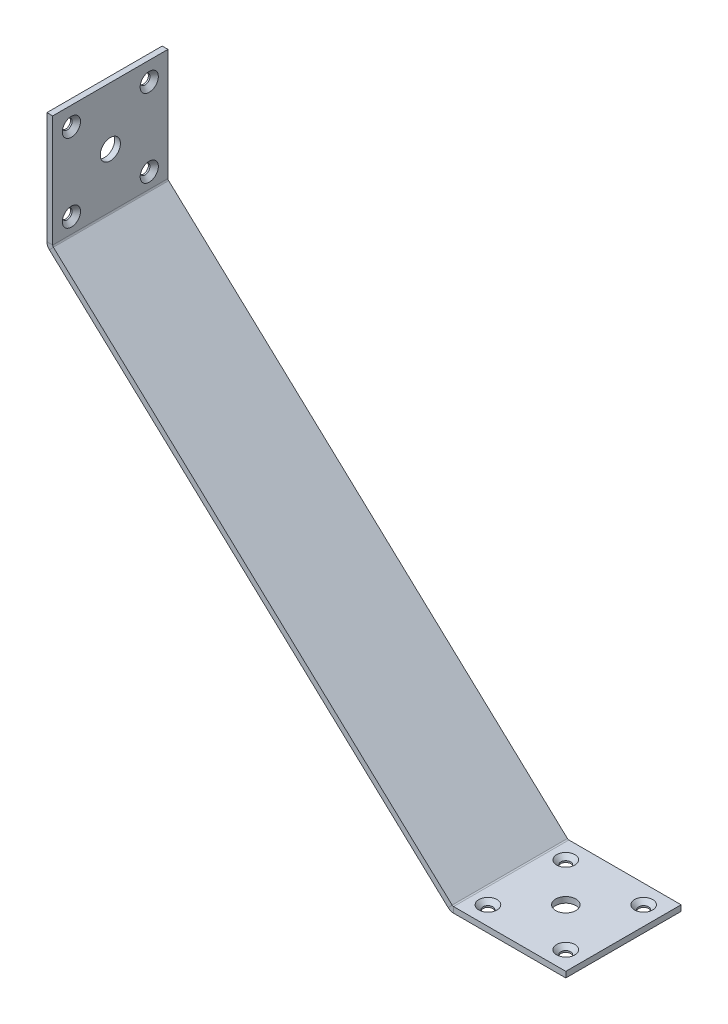
ISO-10303-21;
HEADER;
FILE_DESCRIPTION(('STEP AP214'),'2;1');
FILE_NAME('part.step','',(''),(''),'','','');
FILE_SCHEMA(('AUTOMOTIVE_DESIGN { 1 0 10303 214 1 1 1 1 }'));
ENDSEC;
DATA;
#1=APPLICATION_CONTEXT('core data for automotive mechanical design processes');
#2=APPLICATION_PROTOCOL_DEFINITION('international standard','automotive_design',2000,#1);
#3=PRODUCT_CONTEXT('',#1,'mechanical');
#4=PRODUCT('Part','Part','',(#3));
#5=PRODUCT_RELATED_PRODUCT_CATEGORY('part','',(#4));
#6=PRODUCT_DEFINITION_FORMATION('','',#4);
#7=PRODUCT_DEFINITION_CONTEXT('part definition',#1,'design');
#8=PRODUCT_DEFINITION('design','',#6,#7);
#9=PRODUCT_DEFINITION_SHAPE('','',#8);
#10=(LENGTH_UNIT() NAMED_UNIT(*) SI_UNIT(.MILLI.,.METRE.));
#11=(NAMED_UNIT(*) PLANE_ANGLE_UNIT() SI_UNIT($,.RADIAN.));
#12=(NAMED_UNIT(*) SI_UNIT($,.STERADIAN.) SOLID_ANGLE_UNIT());
#13=UNCERTAINTY_MEASURE_WITH_UNIT(LENGTH_MEASURE(1.E-05),#10,'distance_accuracy_value','');
#14=(GEOMETRIC_REPRESENTATION_CONTEXT(3) GLOBAL_UNCERTAINTY_ASSIGNED_CONTEXT((#13)) GLOBAL_UNIT_ASSIGNED_CONTEXT((#10,
#11,#12)) REPRESENTATION_CONTEXT('',''));
#15=CARTESIAN_POINT('',(0.,0.,0.));
#16=DIRECTION('',(0.,0.,1.));
#17=DIRECTION('',(1.,0.,0.));
#18=AXIS2_PLACEMENT_3D('',#15,#16,#17);
#19=CARTESIAN_POINT('',(0.,131.193347827818,40.));
#20=DIRECTION('',(0.,0.,1.));
#21=DIRECTION('',(1.,0.,0.));
#22=AXIS2_PLACEMENT_3D('',#19,#20,#21);
#23=PLANE('',#22);
#24=DIRECTION('',(1.,0.,0.));
#25=VECTOR('',#24,1.);
#26=CARTESIAN_POINT('',(0.,131.193347827818,40.));
#27=LINE('',#26,#25);
#28=CARTESIAN_POINT('',(0.,131.193347827818,40.));
#29=VERTEX_POINT('',#28);
#30=CARTESIAN_POINT('',(2.,131.193347827818,40.));
#31=VERTEX_POINT('',#30);
#32=EDGE_CURVE('E11',#29,#31,#27,.T.);
#33=ORIENTED_EDGE('',*,*,#32,.F.);
#34=CARTESIAN_POINT('',(2.7366,131.193347827818,40.));
#35=DIRECTION('',(0.,0.,-1.));
#36=DIRECTION('',(-1.,0.,0.));
#37=AXIS2_PLACEMENT_3D('',#34,#35,#36);
#38=CIRCLE('',#37,2.7366);
#39=CARTESIAN_POINT('',(0.874477521471504,129.187985158634,40.));
#40=VERTEX_POINT('',#39);
#41=EDGE_CURVE('E146',#29,#40,#38,.F.);
#42=ORIENTED_EDGE('',*,*,#41,.T.);
#43=DIRECTION('',(-0.680451099367275,-0.732793491626302,0.));
#44=VECTOR('',#43,1.);
#45=CARTESIAN_POINT('',(2.23537972020606,130.653572141886,40.));
#46=LINE('',#45,#44);
#47=CARTESIAN_POINT('',(2.23537972020606,130.653572141886,40.));
#48=VERTEX_POINT('',#47);
#49=EDGE_CURVE('E44',#48,#40,#46,.T.);
#50=ORIENTED_EDGE('',*,*,#49,.F.);
#51=CARTESIAN_POINT('',(2.7366,131.193347827818,40.));
#52=DIRECTION('',(0.,0.,1.));
#53=DIRECTION('',(1.,0.,0.));
#54=AXIS2_PLACEMENT_3D('',#51,#52,#53);
#55=CIRCLE('',#54,0.7366);
#56=EDGE_CURVE('E241',#31,#48,#55,.T.);
#57=ORIENTED_EDGE('',*,*,#56,.F.);
#58=EDGE_LOOP('',(#33,#42,#50,#57));
#59=FACE_BOUND('',#58,.T.);
#60=ADVANCED_FACE('F36',(#59),#23,.T.);
#61=CARTESIAN_POINT('',(2.23537972020606,130.653572141886,40.));
#62=DIRECTION('',(0.,0.,1.));
#63=DIRECTION('',(1.,0.,0.));
#64=AXIS2_PLACEMENT_3D('',#61,#62,#63);
#65=PLANE('',#64);
#66=DIRECTION('',(0.,-1.,0.));
#67=VECTOR('',#66,1.);
#68=CARTESIAN_POINT('',(0.,130.,40.));
#69=LINE('',#68,#67);
#70=CARTESIAN_POINT('',(0.,170.,40.));
#71=VERTEX_POINT('',#70);
#72=EDGE_CURVE('E151',#71,#29,#69,.T.);
#73=ORIENTED_EDGE('',*,*,#72,.T.);
#74=ORIENTED_EDGE('',*,*,#32,.T.);
#75=DIRECTION('',(0.,1.,0.));
#76=VECTOR('',#75,1.);
#77=CARTESIAN_POINT('',(2.,130.,40.));
#78=LINE('',#77,#76);
#79=CARTESIAN_POINT('',(2.,170.,40.));
#80=VERTEX_POINT('',#79);
#81=EDGE_CURVE('E254',#80,#31,#78,.F.);
#82=ORIENTED_EDGE('',*,*,#81,.F.);
#83=DIRECTION('',(1.,0.,0.));
#84=VECTOR('',#83,1.);
#85=CARTESIAN_POINT('',(0.,170.,40.));
#86=LINE('',#85,#84);
#87=EDGE_CURVE('E256',#71,#80,#86,.T.);
#88=ORIENTED_EDGE('',*,*,#87,.F.);
#89=EDGE_LOOP('',(#73,#74,#82,#88));
#90=FACE_BOUND('',#89,.T.);
#91=ADVANCED_FACE('F267',(#90),#65,.T.);
#92=CARTESIAN_POINT('',(0.874477521471504,129.187985158634,0.));
#93=DIRECTION('',(0.,0.,-1.));
#94=DIRECTION('',(-1.,0.,0.));
#95=AXIS2_PLACEMENT_3D('',#92,#93,#94);
#96=PLANE('',#95);
#97=DIRECTION('',(0.680451099367275,0.732793491626302,0.));
#98=VECTOR('',#97,1.);
#99=CARTESIAN_POINT('',(0.874477521471504,129.187985158634,0.));
#100=LINE('',#99,#98);
#101=CARTESIAN_POINT('',(0.874477521471504,129.187985158634,0.));
#102=VERTEX_POINT('',#101);
#103=CARTESIAN_POINT('',(2.23537972020606,130.653572141886,0.));
#104=VERTEX_POINT('',#103);
#105=EDGE_CURVE('E144',#102,#104,#100,.T.);
#106=ORIENTED_EDGE('',*,*,#105,.F.);
#107=CARTESIAN_POINT('',(2.7366,131.193347827818,0.));
#108=DIRECTION('',(0.,0.,-1.));
#109=DIRECTION('',(-1.,0.,0.));
#110=AXIS2_PLACEMENT_3D('',#107,#108,#109);
#111=CIRCLE('',#110,2.7366);
#112=CARTESIAN_POINT('',(0.,131.193347827818,0.));
#113=VERTEX_POINT('',#112);
#114=EDGE_CURVE('E158',#113,#102,#111,.F.);
#115=ORIENTED_EDGE('',*,*,#114,.F.);
#116=DIRECTION('',(-1.,0.,0.));
#117=VECTOR('',#116,1.);
#118=CARTESIAN_POINT('',(2.,131.193347827818,0.));
#119=LINE('',#118,#117);
#120=CARTESIAN_POINT('',(2.,131.193347827818,0.));
#121=VERTEX_POINT('',#120);
#122=EDGE_CURVE('E232',#121,#113,#119,.T.);
#123=ORIENTED_EDGE('',*,*,#122,.F.);
#124=CARTESIAN_POINT('',(2.7366,131.193347827818,0.));
#125=DIRECTION('',(0.,0.,1.));
#126=DIRECTION('',(1.,0.,0.));
#127=AXIS2_PLACEMENT_3D('',#124,#125,#126);
#128=CIRCLE('',#127,0.7366);
#129=EDGE_CURVE('E186',#121,#104,#128,.T.);
#130=ORIENTED_EDGE('',*,*,#129,.T.);
#131=EDGE_LOOP('',(#106,#115,#123,#130));
#132=FACE_BOUND('',#131,.T.);
#133=ADVANCED_FACE('F246',(#132),#96,.T.);
#134=CARTESIAN_POINT('',(2.,131.193347827818,0.));
#135=DIRECTION('',(0.,0.,-1.));
#136=DIRECTION('',(-1.,0.,0.));
#137=AXIS2_PLACEMENT_3D('',#134,#135,#136);
#138=PLANE('',#137);
#139=DIRECTION('',(0.732793491626299,-0.680451099367278,0.));
#140=VECTOR('',#139,1.);
#141=CARTESIAN_POINT('',(0.,130.,0.));
#142=LINE('',#141,#140);
#143=CARTESIAN_POINT('',(139.212513643737,0.731237330815426,0.));
#144=VERTEX_POINT('',#143);
#145=EDGE_CURVE('E199',#102,#144,#142,.T.);
#146=ORIENTED_EDGE('',*,*,#145,.F.);
#147=ORIENTED_EDGE('',*,*,#105,.T.);
#148=DIRECTION('',(0.732793491626299,-0.680451099367278,0.));
#149=VECTOR('',#148,1.);
#150=CARTESIAN_POINT('',(1.36090219873456,131.465586983253,0.));
#151=LINE('',#150,#149);
#152=CARTESIAN_POINT('',(140.573415842472,2.19682431406804,0.));
#153=VERTEX_POINT('',#152);
#154=EDGE_CURVE('E184',#104,#153,#151,.T.);
#155=ORIENTED_EDGE('',*,*,#154,.T.);
#156=DIRECTION('',(-0.680451099367273,-0.732793491626303,0.));
#157=VECTOR('',#156,1.);
#158=CARTESIAN_POINT('',(140.573415842472,2.19682431406804,0.));
#159=LINE('',#158,#157);
#160=EDGE_CURVE('E93',#153,#144,#159,.T.);
#161=ORIENTED_EDGE('',*,*,#160,.T.);
#162=EDGE_LOOP('',(#146,#147,#155,#161));
#163=FACE_BOUND('',#162,.T.);
#164=ADVANCED_FACE('F234',(#163),#138,.T.);
#165=CARTESIAN_POINT('',(139.212513643737,0.731237330815426,40.));
#166=DIRECTION('',(0.,0.,1.));
#167=DIRECTION('',(1.,0.,0.));
#168=AXIS2_PLACEMENT_3D('',#165,#166,#167);
#169=PLANE('',#168);
#170=DIRECTION('',(0.680451099367273,0.732793491626303,0.));
#171=VECTOR('',#170,1.);
#172=CARTESIAN_POINT('',(139.212513643737,0.731237330815426,40.));
#173=LINE('',#172,#171);
#174=CARTESIAN_POINT('',(139.212513643737,0.731237330815426,40.));
#175=VERTEX_POINT('',#174);
#176=CARTESIAN_POINT('',(140.573415842472,2.19682431406804,40.));
#177=VERTEX_POINT('',#176);
#178=EDGE_CURVE('E230',#175,#177,#173,.T.);
#179=ORIENTED_EDGE('',*,*,#178,.F.);
#180=CARTESIAN_POINT('',(141.074636122266,2.73659999999998,40.));
#181=DIRECTION('',(0.,0.,-1.));
#182=DIRECTION('',(-1.,0.,0.));
#183=AXIS2_PLACEMENT_3D('',#180,#181,#182);
#184=CIRCLE('',#183,2.7366);
#185=CARTESIAN_POINT('',(141.074636122266,0.,40.));
#186=VERTEX_POINT('',#185);
#187=EDGE_CURVE('E166',#175,#186,#184,.F.);
#188=ORIENTED_EDGE('',*,*,#187,.T.);
#189=DIRECTION('',(0.,-1.,0.));
#190=VECTOR('',#189,1.);
#191=CARTESIAN_POINT('',(141.074636122266,2.,40.));
#192=LINE('',#191,#190);
#193=CARTESIAN_POINT('',(141.074636122266,2.,40.));
#194=VERTEX_POINT('',#193);
#195=EDGE_CURVE('E52',#194,#186,#192,.T.);
#196=ORIENTED_EDGE('',*,*,#195,.F.);
#197=CARTESIAN_POINT('',(141.074636122266,2.73659999999998,40.));
#198=DIRECTION('',(0.,0.,1.));
#199=DIRECTION('',(1.,0.,0.));
#200=AXIS2_PLACEMENT_3D('',#197,#198,#199);
#201=CIRCLE('',#200,0.7366);
#202=EDGE_CURVE('E258',#177,#194,#201,.T.);
#203=ORIENTED_EDGE('',*,*,#202,.F.);
#204=EDGE_LOOP('',(#179,#188,#196,#203));
#205=FACE_BOUND('',#204,.T.);
#206=ADVANCED_FACE('F295',(#205),#169,.T.);
#207=CARTESIAN_POINT('',(141.074636122266,2.,40.));
#208=DIRECTION('',(0.,0.,1.));
#209=DIRECTION('',(1.,0.,0.));
#210=AXIS2_PLACEMENT_3D('',#207,#208,#209);
#211=PLANE('',#210);
#212=DIRECTION('',(0.732793491626299,-0.680451099367278,0.));
#213=VECTOR('',#212,1.);
#214=CARTESIAN_POINT('',(0.,130.,40.));
#215=LINE('',#214,#213);
#216=EDGE_CURVE('E136',#40,#175,#215,.T.);
#217=ORIENTED_EDGE('',*,*,#216,.T.);
#218=ORIENTED_EDGE('',*,*,#178,.T.);
#219=DIRECTION('',(0.732793491626299,-0.680451099367278,0.));
#220=VECTOR('',#219,1.);
#221=CARTESIAN_POINT('',(1.36090219873456,131.465586983253,40.));
#222=LINE('',#221,#220);
#223=EDGE_CURVE('E139',#48,#177,#222,.T.);
#224=ORIENTED_EDGE('',*,*,#223,.F.);
#225=ORIENTED_EDGE('',*,*,#49,.T.);
#226=EDGE_LOOP('',(#217,#218,#224,#225));
#227=FACE_BOUND('',#226,.T.);
#228=ADVANCED_FACE('F134',(#227),#211,.T.);
#229=CARTESIAN_POINT('',(141.074636122266,0.,0.));
#230=DIRECTION('',(0.,0.,-1.));
#231=DIRECTION('',(-1.,0.,0.));
#232=AXIS2_PLACEMENT_3D('',#229,#230,#231);
#233=PLANE('',#232);
#234=DIRECTION('',(0.,1.,0.));
#235=VECTOR('',#234,1.);
#236=CARTESIAN_POINT('',(141.074636122266,0.,0.));
#237=LINE('',#236,#235);
#238=CARTESIAN_POINT('',(141.074636122266,0.,0.));
#239=VERTEX_POINT('',#238);
#240=CARTESIAN_POINT('',(141.074636122266,2.,0.));
#241=VERTEX_POINT('',#240);
#242=EDGE_CURVE('E100',#239,#241,#237,.T.);
#243=ORIENTED_EDGE('',*,*,#242,.F.);
#244=CARTESIAN_POINT('',(141.074636122266,2.73659999999998,0.));
#245=DIRECTION('',(0.,0.,-1.));
#246=DIRECTION('',(-1.,0.,0.));
#247=AXIS2_PLACEMENT_3D('',#244,#245,#246);
#248=CIRCLE('',#247,2.7366);
#249=EDGE_CURVE('E201',#144,#239,#248,.F.);
#250=ORIENTED_EDGE('',*,*,#249,.F.);
#251=ORIENTED_EDGE('',*,*,#160,.F.);
#252=CARTESIAN_POINT('',(141.074636122266,2.73659999999998,0.));
#253=DIRECTION('',(0.,0.,1.));
#254=DIRECTION('',(1.,0.,0.));
#255=AXIS2_PLACEMENT_3D('',#252,#253,#254);
#256=CIRCLE('',#255,0.7366);
#257=EDGE_CURVE('E182',#153,#241,#256,.T.);
#258=ORIENTED_EDGE('',*,*,#257,.T.);
#259=EDGE_LOOP('',(#243,#250,#251,#258));
#260=FACE_BOUND('',#259,.T.);
#261=ADVANCED_FACE('F301',(#260),#233,.T.);
#262=CARTESIAN_POINT('',(140.573415842472,2.19682431406804,0.));
#263=DIRECTION('',(0.,0.,-1.));
#264=DIRECTION('',(-1.,0.,0.));
#265=AXIS2_PLACEMENT_3D('',#262,#263,#264);
#266=PLANE('',#265);
#267=DIRECTION('',(1.,0.,0.));
#268=VECTOR('',#267,1.);
#269=CARTESIAN_POINT('',(140.,0.,0.));
#270=LINE('',#269,#268);
#271=CARTESIAN_POINT('',(180.,0.,0.));
#272=VERTEX_POINT('',#271);
#273=EDGE_CURVE('E172',#239,#272,#270,.T.);
#274=ORIENTED_EDGE('',*,*,#273,.F.);
#275=ORIENTED_EDGE('',*,*,#242,.T.);
#276=DIRECTION('',(1.,0.,0.));
#277=VECTOR('',#276,1.);
#278=CARTESIAN_POINT('',(140.,2.,0.));
#279=LINE('',#278,#277);
#280=CARTESIAN_POINT('',(180.,2.,0.));
#281=VERTEX_POINT('',#280);
#282=EDGE_CURVE('E179',#241,#281,#279,.T.);
#283=ORIENTED_EDGE('',*,*,#282,.T.);
#284=DIRECTION('',(0.,-1.,0.));
#285=VECTOR('',#284,1.);
#286=CARTESIAN_POINT('',(180.,2.,0.));
#287=LINE('',#286,#285);
#288=EDGE_CURVE('E175',#281,#272,#287,.T.);
#289=ORIENTED_EDGE('',*,*,#288,.T.);
#290=EDGE_LOOP('',(#274,#275,#283,#289));
#291=FACE_BOUND('',#290,.T.);
#292=ADVANCED_FACE('F304',(#291),#266,.T.);
#293=CARTESIAN_POINT('',(140.,0.,40.));
#294=DIRECTION('',(0.,1.,0.));
#295=DIRECTION('',(0.,0.,1.));
#296=AXIS2_PLACEMENT_3D('',#293,#294,#295);
#297=PLANE('',#296);
#298=CARTESIAN_POINT('',(160.,0.,20.));
#299=DIRECTION('',(0.,1.,0.));
#300=DIRECTION('',(0.,0.,1.));
#301=AXIS2_PLACEMENT_3D('',#298,#299,#300);
#302=CIRCLE('',#301,3.49999999999998);
#303=CARTESIAN_POINT('',(160.,0.,23.5));
#304=VERTEX_POINT('',#303);
#305=EDGE_CURVE('E780',#304,#304,#302,.T.);
#306=ORIENTED_EDGE('',*,*,#305,.T.);
#307=EDGE_LOOP('',(#306));
#308=FACE_BOUND('',#307,.T.);
#309=CARTESIAN_POINT('',(173.5,0.,6.5));
#310=DIRECTION('',(0.,1.,0.));
#311=DIRECTION('',(0.,0.,1.));
#312=AXIS2_PLACEMENT_3D('',#309,#310,#311);
#313=CIRCLE('',#312,1.69999999999998);
#314=CARTESIAN_POINT('',(173.5,0.,8.19999999999998));
#315=VERTEX_POINT('',#314);
#316=EDGE_CURVE('E735',#315,#315,#313,.T.);
#317=ORIENTED_EDGE('',*,*,#316,.T.);
#318=EDGE_LOOP('',(#317));
#319=FACE_BOUND('',#318,.T.);
#320=CARTESIAN_POINT('',(173.5,0.,33.5));
#321=DIRECTION('',(0.,1.,0.));
#322=DIRECTION('',(0.,0.,1.));
#323=AXIS2_PLACEMENT_3D('',#320,#321,#322);
#324=CIRCLE('',#323,1.69999999999998);
#325=CARTESIAN_POINT('',(173.5,0.,35.2));
#326=VERTEX_POINT('',#325);
#327=EDGE_CURVE('E726',#326,#326,#324,.T.);
#328=ORIENTED_EDGE('',*,*,#327,.T.);
#329=EDGE_LOOP('',(#328));
#330=FACE_BOUND('',#329,.T.);
#331=CARTESIAN_POINT('',(146.5,0.,33.5));
#332=DIRECTION('',(0.,1.,0.));
#333=DIRECTION('',(0.,0.,1.));
#334=AXIS2_PLACEMENT_3D('',#331,#332,#333);
#335=CIRCLE('',#334,1.69999999999998);
#336=CARTESIAN_POINT('',(146.5,0.,35.2));
#337=VERTEX_POINT('',#336);
#338=EDGE_CURVE('E717',#337,#337,#335,.T.);
#339=ORIENTED_EDGE('',*,*,#338,.T.);
#340=EDGE_LOOP('',(#339));
#341=FACE_BOUND('',#340,.T.);
#342=CARTESIAN_POINT('',(146.5,0.,6.5));
#343=DIRECTION('',(0.,1.,0.));
#344=DIRECTION('',(0.,0.,1.));
#345=AXIS2_PLACEMENT_3D('',#342,#343,#344);
#346=CIRCLE('',#345,1.69999999999998);
#347=CARTESIAN_POINT('',(146.5,0.,8.19999999999998));
#348=VERTEX_POINT('',#347);
#349=EDGE_CURVE('E176',#348,#348,#346,.T.);
#350=ORIENTED_EDGE('',*,*,#349,.T.);
#351=EDGE_LOOP('',(#350));
#352=FACE_BOUND('',#351,.T.);
#353=ORIENTED_EDGE('',*,*,#273,.T.);
#354=DIRECTION('',(0.,0.,-1.));
#355=VECTOR('',#354,1.);
#356=CARTESIAN_POINT('',(180.,0.,40.));
#357=LINE('',#356,#355);
#358=CARTESIAN_POINT('',(180.,0.,40.));
#359=VERTEX_POINT('',#358);
#360=EDGE_CURVE('E225',#359,#272,#357,.T.);
#361=ORIENTED_EDGE('',*,*,#360,.F.);
#362=DIRECTION('',(1.,0.,0.));
#363=VECTOR('',#362,1.);
#364=CARTESIAN_POINT('',(140.,0.,40.));
#365=LINE('',#364,#363);
#366=EDGE_CURVE('E106',#186,#359,#365,.T.);
#367=ORIENTED_EDGE('',*,*,#366,.F.);
#368=DIRECTION('',(0.,0.,-1.));
#369=VECTOR('',#368,1.);
#370=CARTESIAN_POINT('',(141.074636122266,0.,40.));
#371=LINE('',#370,#369);
#372=EDGE_CURVE('E168',#186,#239,#371,.T.);
#373=ORIENTED_EDGE('',*,*,#372,.T.);
#374=EDGE_LOOP('',(#353,#361,#367,#373));
#375=FACE_BOUND('',#374,.T.);
#376=ADVANCED_FACE('F307',(#308,#319,#330,#341,#352,#375),#297,.F.);
#377=CARTESIAN_POINT('',(180.,2.,40.));
#378=DIRECTION('',(1.,0.,0.));
#379=DIRECTION('',(0.,0.,-1.));
#380=AXIS2_PLACEMENT_3D('',#377,#378,#379);
#381=PLANE('',#380);
#382=ORIENTED_EDGE('',*,*,#288,.F.);
#383=DIRECTION('',(0.,0.,-1.));
#384=VECTOR('',#383,1.);
#385=CARTESIAN_POINT('',(180.,2.,40.));
#386=LINE('',#385,#384);
#387=CARTESIAN_POINT('',(180.,2.,40.));
#388=VERTEX_POINT('',#387);
#389=EDGE_CURVE('E223',#388,#281,#386,.T.);
#390=ORIENTED_EDGE('',*,*,#389,.F.);
#391=DIRECTION('',(0.,-1.,0.));
#392=VECTOR('',#391,1.);
#393=CARTESIAN_POINT('',(180.,2.,40.));
#394=LINE('',#393,#392);
#395=EDGE_CURVE('E698',#388,#359,#394,.T.);
#396=ORIENTED_EDGE('',*,*,#395,.T.);
#397=ORIENTED_EDGE('',*,*,#360,.T.);
#398=EDGE_LOOP('',(#382,#390,#396,#397));
#399=FACE_BOUND('',#398,.T.);
#400=ADVANCED_FACE('F311',(#399),#381,.T.);
#401=CARTESIAN_POINT('',(140.,2.,40.));
#402=DIRECTION('',(0.,1.,0.));
#403=DIRECTION('',(0.,0.,1.));
#404=AXIS2_PLACEMENT_3D('',#401,#402,#403);
#405=PLANE('',#404);
#406=CARTESIAN_POINT('',(160.,2.,20.));
#407=DIRECTION('',(0.,1.,0.));
#408=DIRECTION('',(0.,0.,1.));
#409=AXIS2_PLACEMENT_3D('',#406,#407,#408);
#410=CIRCLE('',#409,3.5);
#411=CARTESIAN_POINT('',(160.,2.,23.5));
#412=VERTEX_POINT('',#411);
#413=EDGE_CURVE('E783',#412,#412,#410,.T.);
#414=ORIENTED_EDGE('',*,*,#413,.F.);
#415=EDGE_LOOP('',(#414));
#416=FACE_BOUND('',#415,.T.);
#417=CARTESIAN_POINT('',(173.5,2.,6.5));
#418=DIRECTION('',(0.,1.,0.));
#419=DIRECTION('',(0.,0.,1.));
#420=AXIS2_PLACEMENT_3D('',#417,#418,#419);
#421=CIRCLE('',#420,3.15000000000001);
#422=CARTESIAN_POINT('',(173.5,2.,9.65000000000001));
#423=VERTEX_POINT('',#422);
#424=EDGE_CURVE('E741',#423,#423,#421,.T.);
#425=ORIENTED_EDGE('',*,*,#424,.F.);
#426=EDGE_LOOP('',(#425));
#427=FACE_BOUND('',#426,.T.);
#428=CARTESIAN_POINT('',(173.5,2.,33.5));
#429=DIRECTION('',(0.,1.,0.));
#430=DIRECTION('',(0.,0.,1.));
#431=AXIS2_PLACEMENT_3D('',#428,#429,#430);
#432=CIRCLE('',#431,3.15000000000001);
#433=CARTESIAN_POINT('',(173.5,2.,36.65));
#434=VERTEX_POINT('',#433);
#435=EDGE_CURVE('E732',#434,#434,#432,.T.);
#436=ORIENTED_EDGE('',*,*,#435,.F.);
#437=EDGE_LOOP('',(#436));
#438=FACE_BOUND('',#437,.T.);
#439=CARTESIAN_POINT('',(146.5,2.,33.5));
#440=DIRECTION('',(0.,1.,0.));
#441=DIRECTION('',(0.,0.,1.));
#442=AXIS2_PLACEMENT_3D('',#439,#440,#441);
#443=CIRCLE('',#442,3.15000000000001);
#444=CARTESIAN_POINT('',(146.5,2.,36.65));
#445=VERTEX_POINT('',#444);
#446=EDGE_CURVE('E723',#445,#445,#443,.T.);
#447=ORIENTED_EDGE('',*,*,#446,.F.);
#448=EDGE_LOOP('',(#447));
#449=FACE_BOUND('',#448,.T.);
#450=CARTESIAN_POINT('',(146.5,2.,6.5));
#451=DIRECTION('',(0.,1.,0.));
#452=DIRECTION('',(0.,0.,1.));
#453=AXIS2_PLACEMENT_3D('',#450,#451,#452);
#454=CIRCLE('',#453,3.15000000000001);
#455=CARTESIAN_POINT('',(146.5,2.,9.65000000000001));
#456=VERTEX_POINT('',#455);
#457=EDGE_CURVE('E714',#456,#456,#454,.T.);
#458=ORIENTED_EDGE('',*,*,#457,.F.);
#459=EDGE_LOOP('',(#458));
#460=FACE_BOUND('',#459,.T.);
#461=ORIENTED_EDGE('',*,*,#282,.F.);
#462=DIRECTION('',(0.,0.,-1.));
#463=VECTOR('',#462,1.);
#464=CARTESIAN_POINT('',(141.074636122266,2.,40.));
#465=LINE('',#464,#463);
#466=EDGE_CURVE('E220',#194,#241,#465,.T.);
#467=ORIENTED_EDGE('',*,*,#466,.F.);
#468=DIRECTION('',(1.,0.,0.));
#469=VECTOR('',#468,1.);
#470=CARTESIAN_POINT('',(140.,2.,40.));
#471=LINE('',#470,#469);
#472=EDGE_CURVE('E700',#194,#388,#471,.T.);
#473=ORIENTED_EDGE('',*,*,#472,.T.);
#474=ORIENTED_EDGE('',*,*,#389,.T.);
#475=EDGE_LOOP('',(#461,#467,#473,#474));
#476=FACE_BOUND('',#475,.T.);
#477=ADVANCED_FACE('F315',(#416,#427,#438,#449,#460,#476),#405,.T.);
#478=CARTESIAN_POINT('',(141.074636122266,2.73659999999998,40.));
#479=DIRECTION('',(0.,0.,-1.));
#480=DIRECTION('',(-1.,0.,0.));
#481=AXIS2_PLACEMENT_3D('',#478,#479,#480);
#482=CYLINDRICAL_SURFACE('',#481,0.7366);
#483=ORIENTED_EDGE('',*,*,#257,.F.);
#484=DIRECTION('',(0.,0.,-1.));
#485=VECTOR('',#484,1.);
#486=CARTESIAN_POINT('',(140.573415842472,2.19682431406804,40.));
#487=LINE('',#486,#485);
#488=EDGE_CURVE('E217',#177,#153,#487,.T.);
#489=ORIENTED_EDGE('',*,*,#488,.F.);
#490=ORIENTED_EDGE('',*,*,#202,.T.);
#491=ORIENTED_EDGE('',*,*,#466,.T.);
#492=EDGE_LOOP('',(#483,#489,#490,#491));
#493=FACE_BOUND('',#492,.T.);
#494=ADVANCED_FACE('F319',(#493),#482,.F.);
#495=CARTESIAN_POINT('',(1.36090219873456,131.465586983253,40.));
#496=DIRECTION('',(0.680451099367278,0.732793491626299,0.));
#497=DIRECTION('',(-0.732793491626299,0.680451099367278,0.));
#498=AXIS2_PLACEMENT_3D('',#495,#496,#497);
#499=PLANE('',#498);
#500=ORIENTED_EDGE('',*,*,#154,.F.);
#501=DIRECTION('',(0.,0.,-1.));
#502=VECTOR('',#501,1.);
#503=CARTESIAN_POINT('',(2.23537972020606,130.653572141886,40.));
#504=LINE('',#503,#502);
#505=EDGE_CURVE('E214',#48,#104,#504,.T.);
#506=ORIENTED_EDGE('',*,*,#505,.F.);
#507=ORIENTED_EDGE('',*,*,#223,.T.);
#508=ORIENTED_EDGE('',*,*,#488,.T.);
#509=EDGE_LOOP('',(#500,#506,#507,#508));
#510=FACE_BOUND('',#509,.T.);
#511=ADVANCED_FACE('F243',(#510),#499,.T.);
#512=CARTESIAN_POINT('',(2.7366,131.193347827818,40.));
#513=DIRECTION('',(0.,0.,-1.));
#514=DIRECTION('',(-1.,0.,0.));
#515=AXIS2_PLACEMENT_3D('',#512,#513,#514);
#516=CYLINDRICAL_SURFACE('',#515,0.7366);
#517=ORIENTED_EDGE('',*,*,#129,.F.);
#518=DIRECTION('',(0.,0.,-1.));
#519=VECTOR('',#518,1.);
#520=CARTESIAN_POINT('',(2.,131.193347827818,40.));
#521=LINE('',#520,#519);
#522=EDGE_CURVE('E211',#31,#121,#521,.T.);
#523=ORIENTED_EDGE('',*,*,#522,.F.);
#524=ORIENTED_EDGE('',*,*,#56,.T.);
#525=ORIENTED_EDGE('',*,*,#505,.T.);
#526=EDGE_LOOP('',(#517,#523,#524,#525));
#527=FACE_BOUND('',#526,.T.);
#528=ADVANCED_FACE('F239',(#527),#516,.F.);
#529=CARTESIAN_POINT('',(2.,130.,40.));
#530=DIRECTION('',(1.,0.,0.));
#531=DIRECTION('',(0.,0.,-1.));
#532=AXIS2_PLACEMENT_3D('',#529,#530,#531);
#533=PLANE('',#532);
#534=CARTESIAN_POINT('',(2.,150.,20.));
#535=DIRECTION('',(1.,0.,0.));
#536=DIRECTION('',(0.,0.,-1.));
#537=AXIS2_PLACEMENT_3D('',#534,#535,#536);
#538=CIRCLE('',#537,3.5);
#539=CARTESIAN_POINT('',(2.,150.,16.5));
#540=VERTEX_POINT('',#539);
#541=EDGE_CURVE('E789',#540,#540,#538,.T.);
#542=ORIENTED_EDGE('',*,*,#541,.F.);
#543=EDGE_LOOP('',(#542));
#544=FACE_BOUND('',#543,.T.);
#545=CARTESIAN_POINT('',(2.,163.5,6.5));
#546=DIRECTION('',(1.,0.,0.));
#547=DIRECTION('',(0.,0.,-1.));
#548=AXIS2_PLACEMENT_3D('',#545,#546,#547);
#549=CIRCLE('',#548,3.15000000000001);
#550=CARTESIAN_POINT('',(2.,163.5,3.34999999999999));
#551=VERTEX_POINT('',#550);
#552=EDGE_CURVE('E777',#551,#551,#549,.T.);
#553=ORIENTED_EDGE('',*,*,#552,.F.);
#554=EDGE_LOOP('',(#553));
#555=FACE_BOUND('',#554,.T.);
#556=CARTESIAN_POINT('',(2.,136.5,6.5));
#557=DIRECTION('',(1.,0.,0.));
#558=DIRECTION('',(0.,0.,-1.));
#559=AXIS2_PLACEMENT_3D('',#556,#557,#558);
#560=CIRCLE('',#559,3.14999999999999);
#561=CARTESIAN_POINT('',(2.,136.5,3.35000000000001));
#562=VERTEX_POINT('',#561);
#563=EDGE_CURVE('E768',#562,#562,#560,.T.);
#564=ORIENTED_EDGE('',*,*,#563,.F.);
#565=EDGE_LOOP('',(#564));
#566=FACE_BOUND('',#565,.T.);
#567=CARTESIAN_POINT('',(2.,136.5,33.5));
#568=DIRECTION('',(1.,0.,0.));
#569=DIRECTION('',(0.,0.,-1.));
#570=AXIS2_PLACEMENT_3D('',#567,#568,#569);
#571=CIRCLE('',#570,3.14999999999999);
#572=CARTESIAN_POINT('',(2.,136.5,30.35));
#573=VERTEX_POINT('',#572);
#574=EDGE_CURVE('E759',#573,#573,#571,.T.);
#575=ORIENTED_EDGE('',*,*,#574,.F.);
#576=EDGE_LOOP('',(#575));
#577=FACE_BOUND('',#576,.T.);
#578=CARTESIAN_POINT('',(2.,163.5,33.5));
#579=DIRECTION('',(1.,0.,0.));
#580=DIRECTION('',(0.,0.,-1.));
#581=AXIS2_PLACEMENT_3D('',#578,#579,#580);
#582=CIRCLE('',#581,3.15000000000001);
#583=CARTESIAN_POINT('',(2.,163.5,30.35));
#584=VERTEX_POINT('',#583);
#585=EDGE_CURVE('E750',#584,#584,#582,.T.);
#586=ORIENTED_EDGE('',*,*,#585,.F.);
#587=EDGE_LOOP('',(#586));
#588=FACE_BOUND('',#587,.T.);
#589=DIRECTION('',(0.,1.,0.));
#590=VECTOR('',#589,1.);
#591=CARTESIAN_POINT('',(2.,130.,0.));
#592=LINE('',#591,#590);
#593=CARTESIAN_POINT('',(2.,170.,0.));
#594=VERTEX_POINT('',#593);
#595=EDGE_CURVE('E189',#594,#121,#592,.F.);
#596=ORIENTED_EDGE('',*,*,#595,.F.);
#597=DIRECTION('',(0.,0.,-1.));
#598=VECTOR('',#597,1.);
#599=CARTESIAN_POINT('',(2.,170.,40.));
#600=LINE('',#599,#598);
#601=EDGE_CURVE('E209',#80,#594,#600,.T.);
#602=ORIENTED_EDGE('',*,*,#601,.F.);
#603=ORIENTED_EDGE('',*,*,#81,.T.);
#604=ORIENTED_EDGE('',*,*,#522,.T.);
#605=EDGE_LOOP('',(#596,#602,#603,#604));
#606=FACE_BOUND('',#605,.T.);
#607=ADVANCED_FACE('F252',(#544,#555,#566,#577,#588,#606),#533,.T.);
#608=CARTESIAN_POINT('',(0.,170.,40.));
#609=DIRECTION('',(0.,1.,0.));
#610=DIRECTION('',(0.,0.,1.));
#611=AXIS2_PLACEMENT_3D('',#608,#609,#610);
#612=PLANE('',#611);
#613=DIRECTION('',(1.,0.,0.));
#614=VECTOR('',#613,1.);
#615=CARTESIAN_POINT('',(0.,170.,0.));
#616=LINE('',#615,#614);
#617=CARTESIAN_POINT('',(0.,170.,0.));
#618=VERTEX_POINT('',#617);
#619=EDGE_CURVE('E192',#618,#594,#616,.T.);
#620=ORIENTED_EDGE('',*,*,#619,.F.);
#621=DIRECTION('',(0.,0.,-1.));
#622=VECTOR('',#621,1.);
#623=CARTESIAN_POINT('',(0.,170.,40.));
#624=LINE('',#623,#622);
#625=EDGE_CURVE('E207',#71,#618,#624,.T.);
#626=ORIENTED_EDGE('',*,*,#625,.F.);
#627=ORIENTED_EDGE('',*,*,#87,.T.);
#628=ORIENTED_EDGE('',*,*,#601,.T.);
#629=EDGE_LOOP('',(#620,#626,#627,#628));
#630=FACE_BOUND('',#629,.T.);
#631=ADVANCED_FACE('F273',(#630),#612,.T.);
#632=CARTESIAN_POINT('',(0.,130.,40.));
#633=DIRECTION('',(1.,0.,0.));
#634=DIRECTION('',(0.,0.,-1.));
#635=AXIS2_PLACEMENT_3D('',#632,#633,#634);
#636=PLANE('',#635);
#637=CARTESIAN_POINT('',(0.,150.,20.));
#638=DIRECTION('',(1.,0.,0.));
#639=DIRECTION('',(0.,0.,-1.));
#640=AXIS2_PLACEMENT_3D('',#637,#638,#639);
#641=CIRCLE('',#640,3.49999999999998);
#642=CARTESIAN_POINT('',(0.,150.,16.5));
#643=VERTEX_POINT('',#642);
#644=EDGE_CURVE('E786',#643,#643,#641,.T.);
#645=ORIENTED_EDGE('',*,*,#644,.T.);
#646=EDGE_LOOP('',(#645));
#647=FACE_BOUND('',#646,.T.);
#648=CARTESIAN_POINT('',(0.,163.5,6.5));
#649=DIRECTION('',(1.,0.,0.));
#650=DIRECTION('',(0.,0.,-1.));
#651=AXIS2_PLACEMENT_3D('',#648,#649,#650);
#652=CIRCLE('',#651,1.69999999999998);
#653=CARTESIAN_POINT('',(0.,163.5,4.80000000000002));
#654=VERTEX_POINT('',#653);
#655=EDGE_CURVE('E771',#654,#654,#652,.T.);
#656=ORIENTED_EDGE('',*,*,#655,.T.);
#657=EDGE_LOOP('',(#656));
#658=FACE_BOUND('',#657,.T.);
#659=CARTESIAN_POINT('',(0.,136.5,6.5));
#660=DIRECTION('',(1.,0.,0.));
#661=DIRECTION('',(0.,0.,-1.));
#662=AXIS2_PLACEMENT_3D('',#659,#660,#661);
#663=CIRCLE('',#662,1.69999999999998);
#664=CARTESIAN_POINT('',(0.,136.5,4.80000000000002));
#665=VERTEX_POINT('',#664);
#666=EDGE_CURVE('E762',#665,#665,#663,.T.);
#667=ORIENTED_EDGE('',*,*,#666,.T.);
#668=EDGE_LOOP('',(#667));
#669=FACE_BOUND('',#668,.T.);
#670=CARTESIAN_POINT('',(0.,136.5,33.5));
#671=DIRECTION('',(1.,0.,0.));
#672=DIRECTION('',(0.,0.,-1.));
#673=AXIS2_PLACEMENT_3D('',#670,#671,#672);
#674=CIRCLE('',#673,1.69999999999998);
#675=CARTESIAN_POINT('',(0.,136.5,31.8));
#676=VERTEX_POINT('',#675);
#677=EDGE_CURVE('E753',#676,#676,#674,.T.);
#678=ORIENTED_EDGE('',*,*,#677,.T.);
#679=EDGE_LOOP('',(#678));
#680=FACE_BOUND('',#679,.T.);
#681=CARTESIAN_POINT('',(0.,163.5,33.5));
#682=DIRECTION('',(1.,0.,0.));
#683=DIRECTION('',(0.,0.,-1.));
#684=AXIS2_PLACEMENT_3D('',#681,#682,#683);
#685=CIRCLE('',#684,1.69999999999998);
#686=CARTESIAN_POINT('',(0.,163.5,31.8));
#687=VERTEX_POINT('',#686);
#688=EDGE_CURVE('E744',#687,#687,#685,.T.);
#689=ORIENTED_EDGE('',*,*,#688,.T.);
#690=EDGE_LOOP('',(#689));
#691=FACE_BOUND('',#690,.T.);
#692=DIRECTION('',(0.,-1.,0.));
#693=VECTOR('',#692,1.);
#694=CARTESIAN_POINT('',(0.,130.,0.));
#695=LINE('',#694,#693);
#696=EDGE_CURVE('E195',#618,#113,#695,.T.);
#697=ORIENTED_EDGE('',*,*,#696,.T.);
#698=DIRECTION('',(0.,0.,-1.));
#699=VECTOR('',#698,1.);
#700=CARTESIAN_POINT('',(0.,131.193347827818,40.));
#701=LINE('',#700,#699);
#702=EDGE_CURVE('E160',#29,#113,#701,.T.);
#703=ORIENTED_EDGE('',*,*,#702,.F.);
#704=ORIENTED_EDGE('',*,*,#72,.F.);
#705=ORIENTED_EDGE('',*,*,#625,.T.);
#706=EDGE_LOOP('',(#697,#703,#704,#705));
#707=FACE_BOUND('',#706,.T.);
#708=ADVANCED_FACE('F269',(#647,#658,#669,#680,#691,#707),#636,.F.);
#709=CARTESIAN_POINT('',(2.7366,131.193347827818,40.));
#710=DIRECTION('',(0.,0.,-1.));
#711=DIRECTION('',(-1.,0.,0.));
#712=AXIS2_PLACEMENT_3D('',#709,#710,#711);
#713=CYLINDRICAL_SURFACE('',#712,2.7366);
#714=ORIENTED_EDGE('',*,*,#114,.T.);
#715=DIRECTION('',(0.,0.,-1.));
#716=VECTOR('',#715,1.);
#717=CARTESIAN_POINT('',(0.874477521471504,129.187985158634,40.));
#718=LINE('',#717,#716);
#719=EDGE_CURVE('E155',#40,#102,#718,.T.);
#720=ORIENTED_EDGE('',*,*,#719,.F.);
#721=ORIENTED_EDGE('',*,*,#41,.F.);
#722=ORIENTED_EDGE('',*,*,#702,.T.);
#723=EDGE_LOOP('',(#714,#720,#721,#722));
#724=FACE_BOUND('',#723,.T.);
#725=ADVANCED_FACE('F156',(#724),#713,.T.);
#726=CARTESIAN_POINT('',(0.,130.,40.));
#727=DIRECTION('',(0.680451099367278,0.732793491626299,0.));
#728=DIRECTION('',(-0.732793491626299,0.680451099367278,0.));
#729=AXIS2_PLACEMENT_3D('',#726,#727,#728);
#730=PLANE('',#729);
#731=ORIENTED_EDGE('',*,*,#145,.T.);
#732=DIRECTION('',(0.,0.,-1.));
#733=VECTOR('',#732,1.);
#734=CARTESIAN_POINT('',(139.212513643737,0.731237330815426,40.));
#735=LINE('',#734,#733);
#736=EDGE_CURVE('E161',#175,#144,#735,.T.);
#737=ORIENTED_EDGE('',*,*,#736,.F.);
#738=ORIENTED_EDGE('',*,*,#216,.F.);
#739=ORIENTED_EDGE('',*,*,#719,.T.);
#740=EDGE_LOOP('',(#731,#737,#738,#739));
#741=FACE_BOUND('',#740,.T.);
#742=ADVANCED_FACE('F163',(#741),#730,.F.);
#743=CARTESIAN_POINT('',(141.074636122266,2.73659999999998,40.));
#744=DIRECTION('',(0.,0.,-1.));
#745=DIRECTION('',(-1.,0.,0.));
#746=AXIS2_PLACEMENT_3D('',#743,#744,#745);
#747=CYLINDRICAL_SURFACE('',#746,2.7366);
#748=ORIENTED_EDGE('',*,*,#249,.T.);
#749=ORIENTED_EDGE('',*,*,#372,.F.);
#750=ORIENTED_EDGE('',*,*,#187,.F.);
#751=ORIENTED_EDGE('',*,*,#736,.T.);
#752=EDGE_LOOP('',(#748,#749,#750,#751));
#753=FACE_BOUND('',#752,.T.);
#754=ADVANCED_FACE('F445',(#753),#747,.T.);
#755=CARTESIAN_POINT('',(141.074636122266,2.73659999999998,40.));
#756=DIRECTION('',(0.,0.,1.));
#757=DIRECTION('',(1.,0.,0.));
#758=AXIS2_PLACEMENT_3D('',#755,#756,#757);
#759=PLANE('',#758);
#760=ORIENTED_EDGE('',*,*,#366,.T.);
#761=ORIENTED_EDGE('',*,*,#395,.F.);
#762=ORIENTED_EDGE('',*,*,#472,.F.);
#763=ORIENTED_EDGE('',*,*,#195,.T.);
#764=EDGE_LOOP('',(#760,#761,#762,#763));
#765=FACE_BOUND('',#764,.T.);
#766=ADVANCED_FACE('F442',(#765),#759,.T.);
#767=CARTESIAN_POINT('',(141.074636122266,2.73659999999998,0.));
#768=DIRECTION('',(0.,0.,1.));
#769=DIRECTION('',(1.,0.,0.));
#770=AXIS2_PLACEMENT_3D('',#767,#768,#769);
#771=PLANE('',#770);
#772=ORIENTED_EDGE('',*,*,#595,.T.);
#773=ORIENTED_EDGE('',*,*,#122,.T.);
#774=ORIENTED_EDGE('',*,*,#696,.F.);
#775=ORIENTED_EDGE('',*,*,#619,.T.);
#776=EDGE_LOOP('',(#772,#773,#774,#775));
#777=FACE_BOUND('',#776,.T.);
#778=ADVANCED_FACE('F271',(#777),#771,.F.);
#779=CARTESIAN_POINT('',(146.5,2.,6.5));
#780=DIRECTION('',(0.,1.,0.));
#781=DIRECTION('',(0.,0.,1.));
#782=AXIS2_PLACEMENT_3D('',#779,#780,#781);
#783=CYLINDRICAL_SURFACE('',#782,1.69999999999998);
#784=ORIENTED_EDGE('',*,*,#349,.F.);
#785=EDGE_LOOP('',(#784));
#786=FACE_BOUND('',#785,.T.);
#787=CARTESIAN_POINT('',(146.5,0.549999999999993,6.5));
#788=DIRECTION('',(0.,1.,0.));
#789=DIRECTION('',(0.,0.,1.));
#790=AXIS2_PLACEMENT_3D('',#787,#788,#789);
#791=CIRCLE('',#790,1.69999999999998);
#792=CARTESIAN_POINT('',(146.5,0.549999999999993,8.19999999999998));
#793=VERTEX_POINT('',#792);
#794=EDGE_CURVE('E711',#793,#793,#791,.T.);
#795=ORIENTED_EDGE('',*,*,#794,.T.);
#796=EDGE_LOOP('',(#795));
#797=FACE_BOUND('',#796,.T.);
#798=ADVANCED_FACE('F437',(#786,#797),#783,.F.);
#799=CARTESIAN_POINT('',(146.5,2.,6.5));
#800=DIRECTION('',(0.,1.,0.));
#801=DIRECTION('',(0.,0.,1.));
#802=AXIS2_PLACEMENT_3D('',#799,#800,#801);
#803=CONICAL_SURFACE('',#802,3.15000000000001,0.785398163397457);
#804=ORIENTED_EDGE('',*,*,#794,.F.);
#805=EDGE_LOOP('',(#804));
#806=FACE_BOUND('',#805,.T.);
#807=ORIENTED_EDGE('',*,*,#457,.T.);
#808=EDGE_LOOP('',(#807));
#809=FACE_BOUND('',#808,.T.);
#810=ADVANCED_FACE('F433',(#806,#809),#803,.F.);
#811=CARTESIAN_POINT('',(146.5,2.,33.5));
#812=DIRECTION('',(0.,1.,0.));
#813=DIRECTION('',(0.,0.,1.));
#814=AXIS2_PLACEMENT_3D('',#811,#812,#813);
#815=CYLINDRICAL_SURFACE('',#814,1.69999999999998);
#816=ORIENTED_EDGE('',*,*,#338,.F.);
#817=EDGE_LOOP('',(#816));
#818=FACE_BOUND('',#817,.T.);
#819=CARTESIAN_POINT('',(146.5,0.549999999999993,33.5));
#820=DIRECTION('',(0.,1.,0.));
#821=DIRECTION('',(0.,0.,1.));
#822=AXIS2_PLACEMENT_3D('',#819,#820,#821);
#823=CIRCLE('',#822,1.69999999999998);
#824=CARTESIAN_POINT('',(146.5,0.549999999999993,35.2));
#825=VERTEX_POINT('',#824);
#826=EDGE_CURVE('E720',#825,#825,#823,.T.);
#827=ORIENTED_EDGE('',*,*,#826,.T.);
#828=EDGE_LOOP('',(#827));
#829=FACE_BOUND('',#828,.T.);
#830=ADVANCED_FACE('F429',(#818,#829),#815,.F.);
#831=CARTESIAN_POINT('',(146.5,2.,33.5));
#832=DIRECTION('',(0.,1.,0.));
#833=DIRECTION('',(0.,0.,1.));
#834=AXIS2_PLACEMENT_3D('',#831,#832,#833);
#835=CONICAL_SURFACE('',#834,3.15000000000001,0.785398163397457);
#836=ORIENTED_EDGE('',*,*,#826,.F.);
#837=EDGE_LOOP('',(#836));
#838=FACE_BOUND('',#837,.T.);
#839=ORIENTED_EDGE('',*,*,#446,.T.);
#840=EDGE_LOOP('',(#839));
#841=FACE_BOUND('',#840,.T.);
#842=ADVANCED_FACE('F425',(#838,#841),#835,.F.);
#843=CARTESIAN_POINT('',(173.5,2.,33.5));
#844=DIRECTION('',(0.,1.,0.));
#845=DIRECTION('',(0.,0.,1.));
#846=AXIS2_PLACEMENT_3D('',#843,#844,#845);
#847=CYLINDRICAL_SURFACE('',#846,1.69999999999998);
#848=ORIENTED_EDGE('',*,*,#327,.F.);
#849=EDGE_LOOP('',(#848));
#850=FACE_BOUND('',#849,.T.);
#851=CARTESIAN_POINT('',(173.5,0.549999999999993,33.5));
#852=DIRECTION('',(0.,1.,0.));
#853=DIRECTION('',(0.,0.,1.));
#854=AXIS2_PLACEMENT_3D('',#851,#852,#853);
#855=CIRCLE('',#854,1.69999999999998);
#856=CARTESIAN_POINT('',(173.5,0.549999999999993,35.2));
#857=VERTEX_POINT('',#856);
#858=EDGE_CURVE('E729',#857,#857,#855,.T.);
#859=ORIENTED_EDGE('',*,*,#858,.T.);
#860=EDGE_LOOP('',(#859));
#861=FACE_BOUND('',#860,.T.);
#862=ADVANCED_FACE('F421',(#850,#861),#847,.F.);
#863=CARTESIAN_POINT('',(173.5,2.,33.5));
#864=DIRECTION('',(0.,1.,0.));
#865=DIRECTION('',(0.,0.,1.));
#866=AXIS2_PLACEMENT_3D('',#863,#864,#865);
#867=CONICAL_SURFACE('',#866,3.15000000000001,0.785398163397457);
#868=ORIENTED_EDGE('',*,*,#858,.F.);
#869=EDGE_LOOP('',(#868));
#870=FACE_BOUND('',#869,.T.);
#871=ORIENTED_EDGE('',*,*,#435,.T.);
#872=EDGE_LOOP('',(#871));
#873=FACE_BOUND('',#872,.T.);
#874=ADVANCED_FACE('F417',(#870,#873),#867,.F.);
#875=CARTESIAN_POINT('',(173.5,2.,6.5));
#876=DIRECTION('',(0.,1.,0.));
#877=DIRECTION('',(0.,0.,1.));
#878=AXIS2_PLACEMENT_3D('',#875,#876,#877);
#879=CYLINDRICAL_SURFACE('',#878,1.69999999999998);
#880=ORIENTED_EDGE('',*,*,#316,.F.);
#881=EDGE_LOOP('',(#880));
#882=FACE_BOUND('',#881,.T.);
#883=CARTESIAN_POINT('',(173.5,0.549999999999993,6.5));
#884=DIRECTION('',(0.,1.,0.));
#885=DIRECTION('',(0.,0.,1.));
#886=AXIS2_PLACEMENT_3D('',#883,#884,#885);
#887=CIRCLE('',#886,1.69999999999998);
#888=CARTESIAN_POINT('',(173.5,0.549999999999993,8.19999999999998));
#889=VERTEX_POINT('',#888);
#890=EDGE_CURVE('E738',#889,#889,#887,.T.);
#891=ORIENTED_EDGE('',*,*,#890,.T.);
#892=EDGE_LOOP('',(#891));
#893=FACE_BOUND('',#892,.T.);
#894=ADVANCED_FACE('F413',(#882,#893),#879,.F.);
#895=CARTESIAN_POINT('',(173.5,2.,6.5));
#896=DIRECTION('',(0.,1.,0.));
#897=DIRECTION('',(0.,0.,1.));
#898=AXIS2_PLACEMENT_3D('',#895,#896,#897);
#899=CONICAL_SURFACE('',#898,3.15000000000001,0.785398163397457);
#900=ORIENTED_EDGE('',*,*,#890,.F.);
#901=EDGE_LOOP('',(#900));
#902=FACE_BOUND('',#901,.T.);
#903=ORIENTED_EDGE('',*,*,#424,.T.);
#904=EDGE_LOOP('',(#903));
#905=FACE_BOUND('',#904,.T.);
#906=ADVANCED_FACE('F409',(#902,#905),#899,.F.);
#907=CARTESIAN_POINT('',(2.,163.5,33.5));
#908=DIRECTION('',(1.,0.,0.));
#909=DIRECTION('',(0.,0.,-1.));
#910=AXIS2_PLACEMENT_3D('',#907,#908,#909);
#911=CYLINDRICAL_SURFACE('',#910,1.69999999999998);
#912=ORIENTED_EDGE('',*,*,#688,.F.);
#913=EDGE_LOOP('',(#912));
#914=FACE_BOUND('',#913,.T.);
#915=CARTESIAN_POINT('',(0.549999999999993,163.5,33.5));
#916=DIRECTION('',(1.,0.,0.));
#917=DIRECTION('',(0.,0.,-1.));
#918=AXIS2_PLACEMENT_3D('',#915,#916,#917);
#919=CIRCLE('',#918,1.69999999999998);
#920=CARTESIAN_POINT('',(0.549999999999993,163.5,31.8));
#921=VERTEX_POINT('',#920);
#922=EDGE_CURVE('E747',#921,#921,#919,.T.);
#923=ORIENTED_EDGE('',*,*,#922,.T.);
#924=EDGE_LOOP('',(#923));
#925=FACE_BOUND('',#924,.T.);
#926=ADVANCED_FACE('F405',(#914,#925),#911,.F.);
#927=CARTESIAN_POINT('',(2.,163.5,33.5));
#928=DIRECTION('',(1.,0.,0.));
#929=DIRECTION('',(0.,0.,-1.));
#930=AXIS2_PLACEMENT_3D('',#927,#928,#929);
#931=CONICAL_SURFACE('',#930,3.15000000000001,0.785398163397457);
#932=ORIENTED_EDGE('',*,*,#922,.F.);
#933=EDGE_LOOP('',(#932));
#934=FACE_BOUND('',#933,.T.);
#935=ORIENTED_EDGE('',*,*,#585,.T.);
#936=EDGE_LOOP('',(#935));
#937=FACE_BOUND('',#936,.T.);
#938=ADVANCED_FACE('F401',(#934,#937),#931,.F.);
#939=CARTESIAN_POINT('',(2.,136.5,33.5));
#940=DIRECTION('',(1.,0.,0.));
#941=DIRECTION('',(0.,0.,-1.));
#942=AXIS2_PLACEMENT_3D('',#939,#940,#941);
#943=CYLINDRICAL_SURFACE('',#942,1.69999999999998);
#944=ORIENTED_EDGE('',*,*,#677,.F.);
#945=EDGE_LOOP('',(#944));
#946=FACE_BOUND('',#945,.T.);
#947=CARTESIAN_POINT('',(0.549999999999993,136.5,33.5));
#948=DIRECTION('',(1.,0.,0.));
#949=DIRECTION('',(0.,0.,-1.));
#950=AXIS2_PLACEMENT_3D('',#947,#948,#949);
#951=CIRCLE('',#950,1.69999999999998);
#952=CARTESIAN_POINT('',(0.549999999999993,136.5,31.8));
#953=VERTEX_POINT('',#952);
#954=EDGE_CURVE('E756',#953,#953,#951,.T.);
#955=ORIENTED_EDGE('',*,*,#954,.T.);
#956=EDGE_LOOP('',(#955));
#957=FACE_BOUND('',#956,.T.);
#958=ADVANCED_FACE('F397',(#946,#957),#943,.F.);
#959=CARTESIAN_POINT('',(2.,136.5,33.5));
#960=DIRECTION('',(1.,0.,0.));
#961=DIRECTION('',(0.,0.,-1.));
#962=AXIS2_PLACEMENT_3D('',#959,#960,#961);
#963=CONICAL_SURFACE('',#962,3.14999999999999,0.785398163397448);
#964=ORIENTED_EDGE('',*,*,#954,.F.);
#965=EDGE_LOOP('',(#964));
#966=FACE_BOUND('',#965,.T.);
#967=ORIENTED_EDGE('',*,*,#574,.T.);
#968=EDGE_LOOP('',(#967));
#969=FACE_BOUND('',#968,.T.);
#970=ADVANCED_FACE('F393',(#966,#969),#963,.F.);
#971=CARTESIAN_POINT('',(2.,136.5,6.5));
#972=DIRECTION('',(1.,0.,0.));
#973=DIRECTION('',(0.,0.,-1.));
#974=AXIS2_PLACEMENT_3D('',#971,#972,#973);
#975=CYLINDRICAL_SURFACE('',#974,1.69999999999998);
#976=ORIENTED_EDGE('',*,*,#666,.F.);
#977=EDGE_LOOP('',(#976));
#978=FACE_BOUND('',#977,.T.);
#979=CARTESIAN_POINT('',(0.549999999999993,136.5,6.5));
#980=DIRECTION('',(1.,0.,0.));
#981=DIRECTION('',(0.,0.,-1.));
#982=AXIS2_PLACEMENT_3D('',#979,#980,#981);
#983=CIRCLE('',#982,1.69999999999998);
#984=CARTESIAN_POINT('',(0.549999999999993,136.5,4.80000000000002));
#985=VERTEX_POINT('',#984);
#986=EDGE_CURVE('E765',#985,#985,#983,.T.);
#987=ORIENTED_EDGE('',*,*,#986,.T.);
#988=EDGE_LOOP('',(#987));
#989=FACE_BOUND('',#988,.T.);
#990=ADVANCED_FACE('F389',(#978,#989),#975,.F.);
#991=CARTESIAN_POINT('',(2.,136.5,6.5));
#992=DIRECTION('',(1.,0.,0.));
#993=DIRECTION('',(0.,0.,-1.));
#994=AXIS2_PLACEMENT_3D('',#991,#992,#993);
#995=CONICAL_SURFACE('',#994,3.14999999999999,0.785398163397448);
#996=ORIENTED_EDGE('',*,*,#986,.F.);
#997=EDGE_LOOP('',(#996));
#998=FACE_BOUND('',#997,.T.);
#999=ORIENTED_EDGE('',*,*,#563,.T.);
#1000=EDGE_LOOP('',(#999));
#1001=FACE_BOUND('',#1000,.T.);
#1002=ADVANCED_FACE('F385',(#998,#1001),#995,.F.);
#1003=CARTESIAN_POINT('',(2.,163.5,6.5));
#1004=DIRECTION('',(1.,0.,0.));
#1005=DIRECTION('',(0.,0.,-1.));
#1006=AXIS2_PLACEMENT_3D('',#1003,#1004,#1005);
#1007=CYLINDRICAL_SURFACE('',#1006,1.69999999999998);
#1008=ORIENTED_EDGE('',*,*,#655,.F.);
#1009=EDGE_LOOP('',(#1008));
#1010=FACE_BOUND('',#1009,.T.);
#1011=CARTESIAN_POINT('',(0.549999999999993,163.5,6.5));
#1012=DIRECTION('',(1.,0.,0.));
#1013=DIRECTION('',(0.,0.,-1.));
#1014=AXIS2_PLACEMENT_3D('',#1011,#1012,#1013);
#1015=CIRCLE('',#1014,1.69999999999998);
#1016=CARTESIAN_POINT('',(0.549999999999993,163.5,4.80000000000002));
#1017=VERTEX_POINT('',#1016);
#1018=EDGE_CURVE('E774',#1017,#1017,#1015,.T.);
#1019=ORIENTED_EDGE('',*,*,#1018,.T.);
#1020=EDGE_LOOP('',(#1019));
#1021=FACE_BOUND('',#1020,.T.);
#1022=ADVANCED_FACE('F381',(#1010,#1021),#1007,.F.);
#1023=CARTESIAN_POINT('',(2.,163.5,6.5));
#1024=DIRECTION('',(1.,0.,0.));
#1025=DIRECTION('',(0.,0.,-1.));
#1026=AXIS2_PLACEMENT_3D('',#1023,#1024,#1025);
#1027=CONICAL_SURFACE('',#1026,3.15000000000001,0.785398163397457);
#1028=ORIENTED_EDGE('',*,*,#1018,.F.);
#1029=EDGE_LOOP('',(#1028));
#1030=FACE_BOUND('',#1029,.T.);
#1031=ORIENTED_EDGE('',*,*,#552,.T.);
#1032=EDGE_LOOP('',(#1031));
#1033=FACE_BOUND('',#1032,.T.);
#1034=ADVANCED_FACE('F361',(#1030,#1033),#1027,.F.);
#1035=CARTESIAN_POINT('',(160.,2.,20.));
#1036=DIRECTION('',(0.,1.,0.));
#1037=DIRECTION('',(0.,0.,1.));
#1038=AXIS2_PLACEMENT_3D('',#1035,#1036,#1037);
#1039=CYLINDRICAL_SURFACE('',#1038,3.49999999999999);
#1040=ORIENTED_EDGE('',*,*,#305,.F.);
#1041=EDGE_LOOP('',(#1040));
#1042=FACE_BOUND('',#1041,.T.);
#1043=ORIENTED_EDGE('',*,*,#413,.T.);
#1044=EDGE_LOOP('',(#1043));
#1045=FACE_BOUND('',#1044,.T.);
#1046=ADVANCED_FACE('F355',(#1042,#1045),#1039,.F.);
#1047=CARTESIAN_POINT('',(2.,150.,20.));
#1048=DIRECTION('',(1.,0.,0.));
#1049=DIRECTION('',(0.,0.,-1.));
#1050=AXIS2_PLACEMENT_3D('',#1047,#1048,#1049);
#1051=CYLINDRICAL_SURFACE('',#1050,3.49999999999999);
#1052=ORIENTED_EDGE('',*,*,#644,.F.);
#1053=EDGE_LOOP('',(#1052));
#1054=FACE_BOUND('',#1053,.T.);
#1055=ORIENTED_EDGE('',*,*,#541,.T.);
#1056=EDGE_LOOP('',(#1055));
#1057=FACE_BOUND('',#1056,.T.);
#1058=ADVANCED_FACE('F360',(#1054,#1057),#1051,.F.);
#1059=CLOSED_SHELL('',(#60,#91,#133,#164,#206,#228,#261,#292,#376,#400,#477,#494,#511,#528,#607,
#631,#708,#725,#742,#754,#766,#778,#798,#810,#830,#842,#862,#874,#894,#906,#926,#938,#958,#970,
#990,#1002,#1022,#1034,#1046,#1058));
#1060=MANIFOLD_SOLID_BREP('B2',#1059);
#1061=ADVANCED_BREP_SHAPE_REPRESENTATION('',(#18,#1060),#14);
#1062=SHAPE_DEFINITION_REPRESENTATION(#9,#1061);
ENDSEC;
END-ISO-10303-21;
